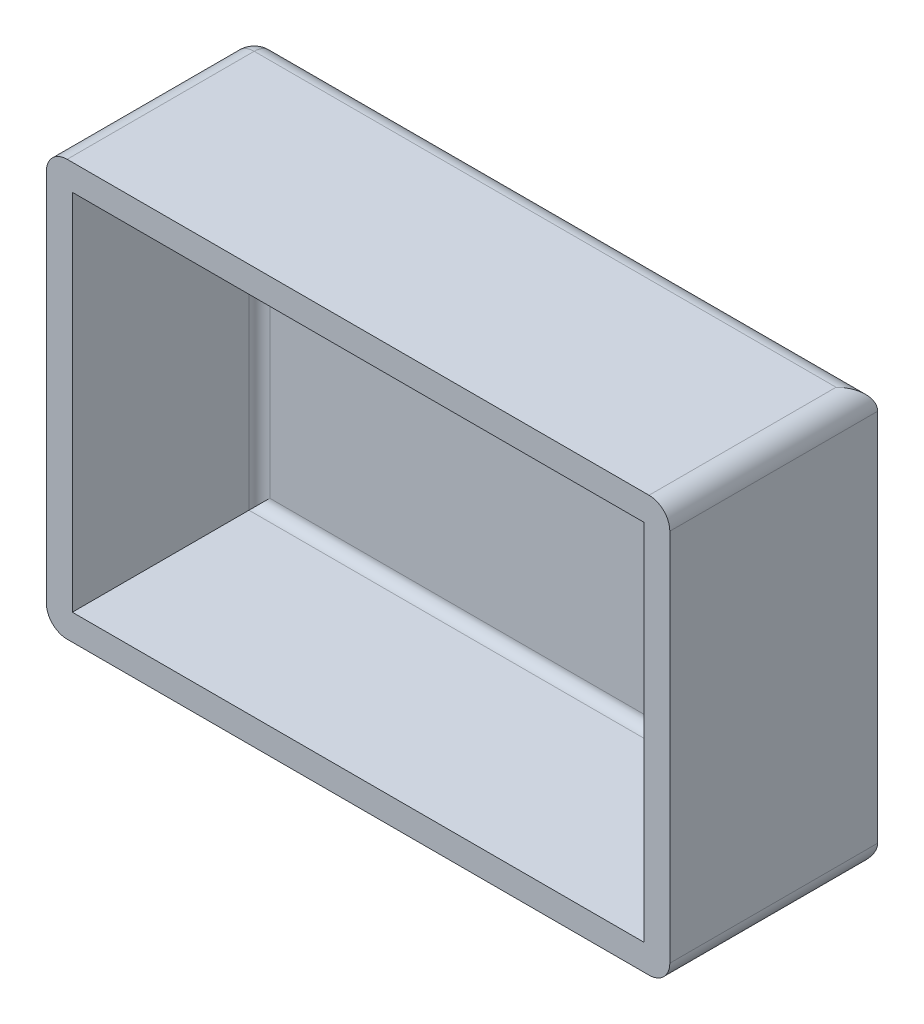
ISO-10303-21;
HEADER;
FILE_DESCRIPTION(('STEP AP214'),'2;1');
FILE_NAME('part.step','',(''),(''),'','','');
FILE_SCHEMA(('AUTOMOTIVE_DESIGN { 1 0 10303 214 1 1 1 1 }'));
ENDSEC;
DATA;
#1=APPLICATION_CONTEXT('core data for automotive mechanical design processes');
#2=APPLICATION_PROTOCOL_DEFINITION('international standard','automotive_design',2000,#1);
#3=PRODUCT_CONTEXT('',#1,'mechanical');
#4=PRODUCT('Part','Part','',(#3));
#5=PRODUCT_RELATED_PRODUCT_CATEGORY('part','',(#4));
#6=PRODUCT_DEFINITION_FORMATION('','',#4);
#7=PRODUCT_DEFINITION_CONTEXT('part definition',#1,'design');
#8=PRODUCT_DEFINITION('design','',#6,#7);
#9=PRODUCT_DEFINITION_SHAPE('','',#8);
#10=(LENGTH_UNIT() NAMED_UNIT(*) SI_UNIT(.MILLI.,.METRE.));
#11=(NAMED_UNIT(*) PLANE_ANGLE_UNIT() SI_UNIT($,.RADIAN.));
#12=(NAMED_UNIT(*) SI_UNIT($,.STERADIAN.) SOLID_ANGLE_UNIT());
#13=UNCERTAINTY_MEASURE_WITH_UNIT(LENGTH_MEASURE(1.E-05),#10,'distance_accuracy_value','');
#14=(GEOMETRIC_REPRESENTATION_CONTEXT(3) GLOBAL_UNCERTAINTY_ASSIGNED_CONTEXT((#13)) GLOBAL_UNIT_ASSIGNED_CONTEXT((#10,
#11,#12)) REPRESENTATION_CONTEXT('',''));
#15=CARTESIAN_POINT('',(0.,0.,0.));
#16=DIRECTION('',(0.,0.,1.));
#17=DIRECTION('',(1.,0.,0.));
#18=AXIS2_PLACEMENT_3D('',#15,#16,#17);
#19=CARTESIAN_POINT('',(30.,-20.,20.));
#20=DIRECTION('',(-1.,0.,0.));
#21=DIRECTION('',(0.,0.,1.));
#22=AXIS2_PLACEMENT_3D('',#19,#20,#21);
#23=PLANE('',#22);
#24=DIRECTION('',(0.,1.,0.));
#25=VECTOR('',#24,1.);
#26=CARTESIAN_POINT('',(30.,-20.,20.));
#27=LINE('',#26,#25);
#28=CARTESIAN_POINT('',(30.,-18.,20.));
#29=VERTEX_POINT('',#28);
#30=CARTESIAN_POINT('',(30.,18.,20.));
#31=VERTEX_POINT('',#30);
#32=EDGE_CURVE('E175',#29,#31,#27,.T.);
#33=ORIENTED_EDGE('',*,*,#32,.F.);
#34=DIRECTION('',(0.,0.,-1.));
#35=VECTOR('',#34,1.);
#36=CARTESIAN_POINT('',(30.,-18.,20.));
#37=LINE('',#36,#35);
#38=CARTESIAN_POINT('',(30.,-18.,0.));
#39=VERTEX_POINT('',#38);
#40=EDGE_CURVE('E244',#29,#39,#37,.T.);
#41=ORIENTED_EDGE('',*,*,#40,.T.);
#42=DIRECTION('',(0.,1.,0.));
#43=VECTOR('',#42,1.);
#44=CARTESIAN_POINT('',(30.,-20.,0.));
#45=LINE('',#44,#43);
#46=CARTESIAN_POINT('',(30.,18.,0.));
#47=VERTEX_POINT('',#46);
#48=EDGE_CURVE('E172',#39,#47,#45,.T.);
#49=ORIENTED_EDGE('',*,*,#48,.T.);
#50=DIRECTION('',(0.,0.,-1.));
#51=VECTOR('',#50,1.);
#52=CARTESIAN_POINT('',(30.,18.,20.));
#53=LINE('',#52,#51);
#54=EDGE_CURVE('E242',#47,#31,#53,.F.);
#55=ORIENTED_EDGE('',*,*,#54,.T.);
#56=EDGE_LOOP('',(#33,#41,#49,#55));
#57=FACE_BOUND('',#56,.T.);
#58=ADVANCED_FACE('F33',(#57),#23,.F.);
#59=CARTESIAN_POINT('',(-30.,20.,20.));
#60=DIRECTION('',(0.,-1.,0.));
#61=DIRECTION('',(0.,0.,-1.));
#62=AXIS2_PLACEMENT_3D('',#59,#60,#61);
#63=PLANE('',#62);
#64=DIRECTION('',(-1.,0.,0.));
#65=VECTOR('',#64,1.);
#66=CARTESIAN_POINT('',(-30.,20.,20.));
#67=LINE('',#66,#65);
#68=CARTESIAN_POINT('',(28.,20.,20.));
#69=VERTEX_POINT('',#68);
#70=CARTESIAN_POINT('',(-28.,20.,20.));
#71=VERTEX_POINT('',#70);
#72=EDGE_CURVE('E178',#69,#71,#67,.T.);
#73=ORIENTED_EDGE('',*,*,#72,.F.);
#74=DIRECTION('',(0.,0.,-1.));
#75=VECTOR('',#74,1.);
#76=CARTESIAN_POINT('',(28.,20.,20.));
#77=LINE('',#76,#75);
#78=CARTESIAN_POINT('',(28.,20.,2.));
#79=VERTEX_POINT('',#78);
#80=EDGE_CURVE('E11',#69,#79,#77,.T.);
#81=ORIENTED_EDGE('',*,*,#80,.T.);
#82=DIRECTION('',(-1.,0.,0.));
#83=VECTOR('',#82,1.);
#84=CARTESIAN_POINT('',(-30.,20.,2.));
#85=LINE('',#84,#83);
#86=CARTESIAN_POINT('',(-28.,20.,2.));
#87=VERTEX_POINT('',#86);
#88=EDGE_CURVE('E42',#79,#87,#85,.T.);
#89=ORIENTED_EDGE('',*,*,#88,.T.);
#90=DIRECTION('',(0.,0.,-1.));
#91=VECTOR('',#90,1.);
#92=CARTESIAN_POINT('',(-28.,20.,20.));
#93=LINE('',#92,#91);
#94=EDGE_CURVE('E246',#87,#71,#93,.F.);
#95=ORIENTED_EDGE('',*,*,#94,.T.);
#96=EDGE_LOOP('',(#73,#81,#89,#95));
#97=FACE_BOUND('',#96,.T.);
#98=ADVANCED_FACE('F325',(#97),#63,.F.);
#99=CARTESIAN_POINT('',(-30.,-20.,20.));
#100=DIRECTION('',(1.,0.,0.));
#101=DIRECTION('',(0.,0.,-1.));
#102=AXIS2_PLACEMENT_3D('',#99,#100,#101);
#103=PLANE('',#102);
#104=DIRECTION('',(0.,-1.,0.));
#105=VECTOR('',#104,1.);
#106=CARTESIAN_POINT('',(-30.,-20.,2.));
#107=LINE('',#106,#105);
#108=CARTESIAN_POINT('',(-30.,18.,2.));
#109=VERTEX_POINT('',#108);
#110=CARTESIAN_POINT('',(-30.,-18.,2.));
#111=VERTEX_POINT('',#110);
#112=EDGE_CURVE('E222',#109,#111,#107,.T.);
#113=ORIENTED_EDGE('',*,*,#112,.T.);
#114=DIRECTION('',(0.,0.,-1.));
#115=VECTOR('',#114,1.);
#116=CARTESIAN_POINT('',(-30.,-18.,20.));
#117=LINE('',#116,#115);
#118=CARTESIAN_POINT('',(-30.,-18.,20.));
#119=VERTEX_POINT('',#118);
#120=EDGE_CURVE('E226',#111,#119,#117,.F.);
#121=ORIENTED_EDGE('',*,*,#120,.T.);
#122=DIRECTION('',(0.,-1.,0.));
#123=VECTOR('',#122,1.);
#124=CARTESIAN_POINT('',(-30.,-20.,20.));
#125=LINE('',#124,#123);
#126=CARTESIAN_POINT('',(-30.,18.,20.));
#127=VERTEX_POINT('',#126);
#128=EDGE_CURVE('E181',#127,#119,#125,.T.);
#129=ORIENTED_EDGE('',*,*,#128,.F.);
#130=DIRECTION('',(0.,0.,-1.));
#131=VECTOR('',#130,1.);
#132=CARTESIAN_POINT('',(-30.,18.,20.));
#133=LINE('',#132,#131);
#134=EDGE_CURVE('E224',#127,#109,#133,.T.);
#135=ORIENTED_EDGE('',*,*,#134,.T.);
#136=EDGE_LOOP('',(#113,#121,#129,#135));
#137=FACE_BOUND('',#136,.T.);
#138=ADVANCED_FACE('F309',(#137),#103,.F.);
#139=CARTESIAN_POINT('',(-30.,-20.,20.));
#140=DIRECTION('',(0.,1.,0.));
#141=DIRECTION('',(0.,0.,1.));
#142=AXIS2_PLACEMENT_3D('',#139,#140,#141);
#143=PLANE('',#142);
#144=DIRECTION('',(1.,0.,0.));
#145=VECTOR('',#144,1.);
#146=CARTESIAN_POINT('',(-30.,-20.,20.));
#147=LINE('',#146,#145);
#148=CARTESIAN_POINT('',(-28.,-20.,20.));
#149=VERTEX_POINT('',#148);
#150=CARTESIAN_POINT('',(28.,-20.,20.));
#151=VERTEX_POINT('',#150);
#152=EDGE_CURVE('E184',#149,#151,#147,.T.);
#153=ORIENTED_EDGE('',*,*,#152,.F.);
#154=DIRECTION('',(0.,0.,-1.));
#155=VECTOR('',#154,1.);
#156=CARTESIAN_POINT('',(-28.,-20.,20.));
#157=LINE('',#156,#155);
#158=CARTESIAN_POINT('',(-28.,-20.,2.));
#159=VERTEX_POINT('',#158);
#160=EDGE_CURVE('E219',#149,#159,#157,.T.);
#161=ORIENTED_EDGE('',*,*,#160,.T.);
#162=DIRECTION('',(1.,0.,0.));
#163=VECTOR('',#162,1.);
#164=CARTESIAN_POINT('',(30.,-20.,2.));
#165=LINE('',#164,#163);
#166=CARTESIAN_POINT('',(28.,-20.,2.));
#167=VERTEX_POINT('',#166);
#168=EDGE_CURVE('E217',#159,#167,#165,.T.);
#169=ORIENTED_EDGE('',*,*,#168,.T.);
#170=DIRECTION('',(0.,0.,-1.));
#171=VECTOR('',#170,1.);
#172=CARTESIAN_POINT('',(28.,-20.,20.));
#173=LINE('',#172,#171);
#174=EDGE_CURVE('E205',#167,#151,#173,.F.);
#175=ORIENTED_EDGE('',*,*,#174,.T.);
#176=EDGE_LOOP('',(#153,#161,#169,#175));
#177=FACE_BOUND('',#176,.T.);
#178=ADVANCED_FACE('F480',(#177),#143,.F.);
#179=CARTESIAN_POINT('',(0.,0.,20.));
#180=DIRECTION('',(0.,0.,-1.));
#181=DIRECTION('',(-1.,0.,0.));
#182=AXIS2_PLACEMENT_3D('',#179,#180,#181);
#183=PLANE('',#182);
#184=DIRECTION('',(-1.,0.,0.));
#185=VECTOR('',#184,1.);
#186=CARTESIAN_POINT('',(-27.5,17.5,20.));
#187=LINE('',#186,#185);
#188=CARTESIAN_POINT('',(27.5,17.5,20.));
#189=VERTEX_POINT('',#188);
#190=CARTESIAN_POINT('',(-27.5,17.5,20.));
#191=VERTEX_POINT('',#190);
#192=EDGE_CURVE('E154',#189,#191,#187,.T.);
#193=ORIENTED_EDGE('',*,*,#192,.F.);
#194=DIRECTION('',(0.,1.,0.));
#195=VECTOR('',#194,1.);
#196=CARTESIAN_POINT('',(27.5,-17.5,20.));
#197=LINE('',#196,#195);
#198=CARTESIAN_POINT('',(27.5,-17.5,20.));
#199=VERTEX_POINT('',#198);
#200=EDGE_CURVE('E160',#199,#189,#197,.T.);
#201=ORIENTED_EDGE('',*,*,#200,.F.);
#202=DIRECTION('',(1.,0.,0.));
#203=VECTOR('',#202,1.);
#204=CARTESIAN_POINT('',(-27.5,-17.5,20.));
#205=LINE('',#204,#203);
#206=CARTESIAN_POINT('',(-27.5,-17.5,20.));
#207=VERTEX_POINT('',#206);
#208=EDGE_CURVE('E165',#207,#199,#205,.T.);
#209=ORIENTED_EDGE('',*,*,#208,.F.);
#210=DIRECTION('',(0.,-1.,0.));
#211=VECTOR('',#210,1.);
#212=CARTESIAN_POINT('',(-27.5,-17.5,20.));
#213=LINE('',#212,#211);
#214=EDGE_CURVE('E145',#191,#207,#213,.T.);
#215=ORIENTED_EDGE('',*,*,#214,.F.);
#216=EDGE_LOOP('',(#193,#201,#209,#215));
#217=FACE_BOUND('',#216,.T.);
#218=ORIENTED_EDGE('',*,*,#128,.T.);
#219=CARTESIAN_POINT('',(-28.,-18.,20.));
#220=DIRECTION('',(0.,0.,-1.));
#221=DIRECTION('',(-1.,0.,0.));
#222=AXIS2_PLACEMENT_3D('',#219,#220,#221);
#223=CIRCLE('',#222,2.);
#224=EDGE_CURVE('E234',#119,#149,#223,.F.);
#225=ORIENTED_EDGE('',*,*,#224,.T.);
#226=ORIENTED_EDGE('',*,*,#152,.T.);
#227=CARTESIAN_POINT('',(28.,-18.,20.));
#228=DIRECTION('',(0.,0.,-1.));
#229=DIRECTION('',(-1.,0.,0.));
#230=AXIS2_PLACEMENT_3D('',#227,#228,#229);
#231=CIRCLE('',#230,2.);
#232=EDGE_CURVE('E232',#151,#29,#231,.F.);
#233=ORIENTED_EDGE('',*,*,#232,.T.);
#234=ORIENTED_EDGE('',*,*,#32,.T.);
#235=CARTESIAN_POINT('',(28.,18.,20.));
#236=DIRECTION('',(0.,0.,-1.));
#237=DIRECTION('',(-1.,0.,0.));
#238=AXIS2_PLACEMENT_3D('',#235,#236,#237);
#239=CIRCLE('',#238,2.);
#240=EDGE_CURVE('E230',#31,#69,#239,.F.);
#241=ORIENTED_EDGE('',*,*,#240,.T.);
#242=ORIENTED_EDGE('',*,*,#72,.T.);
#243=CARTESIAN_POINT('',(-28.,18.,20.));
#244=DIRECTION('',(0.,0.,-1.));
#245=DIRECTION('',(-1.,0.,0.));
#246=AXIS2_PLACEMENT_3D('',#243,#244,#245);
#247=CIRCLE('',#246,2.);
#248=EDGE_CURVE('E228',#71,#127,#247,.F.);
#249=ORIENTED_EDGE('',*,*,#248,.T.);
#250=EDGE_LOOP('',(#218,#225,#226,#233,#234,#241,#242,#249));
#251=FACE_BOUND('',#250,.T.);
#252=ADVANCED_FACE('F162',(#217,#251),#183,.F.);
#253=CARTESIAN_POINT('',(0.,0.,0.));
#254=DIRECTION('',(0.,0.,-1.));
#255=DIRECTION('',(-1.,0.,0.));
#256=AXIS2_PLACEMENT_3D('',#253,#254,#255);
#257=PLANE('',#256);
#258=ORIENTED_EDGE('',*,*,#48,.F.);
#259=DIRECTION('',(1.,0.,0.));
#260=VECTOR('',#259,1.);
#261=CARTESIAN_POINT('',(-30.,-18.,0.));
#262=LINE('',#261,#260);
#263=CARTESIAN_POINT('',(-28.,-18.,0.));
#264=VERTEX_POINT('',#263);
#265=EDGE_CURVE('E240',#39,#264,#262,.F.);
#266=ORIENTED_EDGE('',*,*,#265,.T.);
#267=DIRECTION('',(0.,-1.,0.));
#268=VECTOR('',#267,1.);
#269=CARTESIAN_POINT('',(-28.,20.,0.));
#270=LINE('',#269,#268);
#271=CARTESIAN_POINT('',(-28.,18.,0.));
#272=VERTEX_POINT('',#271);
#273=EDGE_CURVE('E236',#264,#272,#270,.F.);
#274=ORIENTED_EDGE('',*,*,#273,.T.);
#275=DIRECTION('',(-1.,0.,0.));
#276=VECTOR('',#275,1.);
#277=CARTESIAN_POINT('',(30.,18.,0.));
#278=LINE('',#277,#276);
#279=EDGE_CURVE('E238',#272,#47,#278,.F.);
#280=ORIENTED_EDGE('',*,*,#279,.T.);
#281=EDGE_LOOP('',(#258,#266,#274,#280));
#282=FACE_BOUND('',#281,.T.);
#283=ADVANCED_FACE('F289',(#282),#257,.T.);
#284=CARTESIAN_POINT('',(27.5,-17.5,2.));
#285=DIRECTION('',(1.,0.,0.));
#286=DIRECTION('',(0.,0.,-1.));
#287=AXIS2_PLACEMENT_3D('',#284,#285,#286);
#288=PLANE('',#287);
#289=DIRECTION('',(0.,0.,1.));
#290=VECTOR('',#289,1.);
#291=CARTESIAN_POINT('',(27.5,17.5,2.));
#292=LINE('',#291,#290);
#293=CARTESIAN_POINT('',(27.5,17.5,3.));
#294=VERTEX_POINT('',#293);
#295=EDGE_CURVE('E151',#294,#189,#292,.T.);
#296=ORIENTED_EDGE('',*,*,#295,.F.);
#297=DIRECTION('',(0.,1.,0.));
#298=VECTOR('',#297,1.);
#299=CARTESIAN_POINT('',(27.5,-17.5,3.));
#300=LINE('',#299,#298);
#301=CARTESIAN_POINT('',(27.5,-17.5,3.));
#302=VERTEX_POINT('',#301);
#303=EDGE_CURVE('E199',#294,#302,#300,.F.);
#304=ORIENTED_EDGE('',*,*,#303,.T.);
#305=DIRECTION('',(0.,0.,1.));
#306=VECTOR('',#305,1.);
#307=CARTESIAN_POINT('',(27.5,-17.5,2.));
#308=LINE('',#307,#306);
#309=EDGE_CURVE('E170',#302,#199,#308,.T.);
#310=ORIENTED_EDGE('',*,*,#309,.T.);
#311=ORIENTED_EDGE('',*,*,#200,.T.);
#312=EDGE_LOOP('',(#296,#304,#310,#311));
#313=FACE_BOUND('',#312,.T.);
#314=ADVANCED_FACE('F457',(#313),#288,.F.);
#315=CARTESIAN_POINT('',(-27.5,-17.5,2.));
#316=DIRECTION('',(0.,-1.,0.));
#317=DIRECTION('',(0.,0.,-1.));
#318=AXIS2_PLACEMENT_3D('',#315,#316,#317);
#319=PLANE('',#318);
#320=ORIENTED_EDGE('',*,*,#309,.F.);
#321=DIRECTION('',(1.,0.,0.));
#322=VECTOR('',#321,1.);
#323=CARTESIAN_POINT('',(-27.5,-17.5,3.));
#324=LINE('',#323,#322);
#325=CARTESIAN_POINT('',(-27.5,-17.5,3.));
#326=VERTEX_POINT('',#325);
#327=EDGE_CURVE('E201',#302,#326,#324,.F.);
#328=ORIENTED_EDGE('',*,*,#327,.T.);
#329=DIRECTION('',(0.,0.,1.));
#330=VECTOR('',#329,1.);
#331=CARTESIAN_POINT('',(-27.5,-17.5,2.));
#332=LINE('',#331,#330);
#333=EDGE_CURVE('E150',#326,#207,#332,.T.);
#334=ORIENTED_EDGE('',*,*,#333,.T.);
#335=ORIENTED_EDGE('',*,*,#208,.T.);
#336=EDGE_LOOP('',(#320,#328,#334,#335));
#337=FACE_BOUND('',#336,.T.);
#338=ADVANCED_FACE('F449',(#337),#319,.F.);
#339=CARTESIAN_POINT('',(-27.5,-17.5,2.));
#340=DIRECTION('',(-1.,0.,0.));
#341=DIRECTION('',(0.,0.,1.));
#342=AXIS2_PLACEMENT_3D('',#339,#340,#341);
#343=PLANE('',#342);
#344=ORIENTED_EDGE('',*,*,#333,.F.);
#345=DIRECTION('',(0.,-1.,0.));
#346=VECTOR('',#345,1.);
#347=CARTESIAN_POINT('',(-27.5,17.5,3.));
#348=LINE('',#347,#346);
#349=CARTESIAN_POINT('',(-27.5,17.5,3.));
#350=VERTEX_POINT('',#349);
#351=EDGE_CURVE('E148',#326,#350,#348,.F.);
#352=ORIENTED_EDGE('',*,*,#351,.T.);
#353=DIRECTION('',(0.,0.,1.));
#354=VECTOR('',#353,1.);
#355=CARTESIAN_POINT('',(-27.5,17.5,2.));
#356=LINE('',#355,#354);
#357=EDGE_CURVE('E140',#350,#191,#356,.T.);
#358=ORIENTED_EDGE('',*,*,#357,.T.);
#359=ORIENTED_EDGE('',*,*,#214,.T.);
#360=EDGE_LOOP('',(#344,#352,#358,#359));
#361=FACE_BOUND('',#360,.T.);
#362=ADVANCED_FACE('F143',(#361),#343,.F.);
#363=CARTESIAN_POINT('',(-27.5,17.5,2.));
#364=DIRECTION('',(0.,1.,0.));
#365=DIRECTION('',(0.,0.,1.));
#366=AXIS2_PLACEMENT_3D('',#363,#364,#365);
#367=PLANE('',#366);
#368=ORIENTED_EDGE('',*,*,#357,.F.);
#369=DIRECTION('',(-1.,0.,0.));
#370=VECTOR('',#369,1.);
#371=CARTESIAN_POINT('',(27.5,17.5,3.));
#372=LINE('',#371,#370);
#373=EDGE_CURVE('E203',#350,#294,#372,.F.);
#374=ORIENTED_EDGE('',*,*,#373,.T.);
#375=ORIENTED_EDGE('',*,*,#295,.T.);
#376=ORIENTED_EDGE('',*,*,#192,.T.);
#377=EDGE_LOOP('',(#368,#374,#375,#376));
#378=FACE_BOUND('',#377,.T.);
#379=ADVANCED_FACE('F155',(#378),#367,.F.);
#380=CARTESIAN_POINT('',(0.,0.,2.));
#381=DIRECTION('',(0.,0.,-1.));
#382=DIRECTION('',(-1.,0.,0.));
#383=AXIS2_PLACEMENT_3D('',#380,#381,#382);
#384=PLANE('',#383);
#385=DIRECTION('',(0.,-1.,0.));
#386=VECTOR('',#385,1.);
#387=CARTESIAN_POINT('',(-26.5,-17.5,2.));
#388=LINE('',#387,#386);
#389=CARTESIAN_POINT('',(-26.5,16.5,2.));
#390=VERTEX_POINT('',#389);
#391=CARTESIAN_POINT('',(-26.5,-16.5,2.));
#392=VERTEX_POINT('',#391);
#393=EDGE_CURVE('E193',#390,#392,#388,.T.);
#394=ORIENTED_EDGE('',*,*,#393,.T.);
#395=DIRECTION('',(1.,0.,0.));
#396=VECTOR('',#395,1.);
#397=CARTESIAN_POINT('',(27.5,-16.5,2.));
#398=LINE('',#397,#396);
#399=CARTESIAN_POINT('',(26.5,-16.5,2.));
#400=VERTEX_POINT('',#399);
#401=EDGE_CURVE('E196',#392,#400,#398,.T.);
#402=ORIENTED_EDGE('',*,*,#401,.T.);
#403=DIRECTION('',(0.,1.,0.));
#404=VECTOR('',#403,1.);
#405=CARTESIAN_POINT('',(26.5,17.5,2.));
#406=LINE('',#405,#404);
#407=CARTESIAN_POINT('',(26.5,16.5,2.));
#408=VERTEX_POINT('',#407);
#409=EDGE_CURVE('E191',#400,#408,#406,.T.);
#410=ORIENTED_EDGE('',*,*,#409,.T.);
#411=DIRECTION('',(-1.,0.,0.));
#412=VECTOR('',#411,1.);
#413=CARTESIAN_POINT('',(-27.5,16.5,2.));
#414=LINE('',#413,#412);
#415=EDGE_CURVE('E187',#408,#390,#414,.T.);
#416=ORIENTED_EDGE('',*,*,#415,.T.);
#417=EDGE_LOOP('',(#394,#402,#410,#416));
#418=FACE_BOUND('',#417,.T.);
#419=ADVANCED_FACE('F349',(#418),#384,.F.);
#420=CARTESIAN_POINT('',(26.5,0.,3.));
#421=DIRECTION('',(0.,-1.,0.));
#422=DIRECTION('',(0.,0.,-1.));
#423=AXIS2_PLACEMENT_3D('',#420,#421,#422);
#424=CYLINDRICAL_SURFACE('',#423,1.);
#425=CARTESIAN_POINT('',(26.5,-16.5,3.));
#426=DIRECTION('',(-0.707106781186547,-0.707106781186547,0.));
#427=DIRECTION('',(0.707106781186547,-0.707106781186547,0.));
#428=AXIS2_PLACEMENT_3D('',#425,#426,#427);
#429=ELLIPSE('',#428,1.41421356237309,1.);
#430=EDGE_CURVE('E210',#302,#400,#429,.F.);
#431=ORIENTED_EDGE('',*,*,#430,.F.);
#432=ORIENTED_EDGE('',*,*,#303,.F.);
#433=CARTESIAN_POINT('',(26.5,16.5,3.));
#434=DIRECTION('',(0.707106781186547,-0.707106781186547,0.));
#435=DIRECTION('',(-0.707106781186547,-0.707106781186547,0.));
#436=AXIS2_PLACEMENT_3D('',#433,#434,#435);
#437=ELLIPSE('',#436,1.41421356237309,1.);
#438=EDGE_CURVE('E213',#408,#294,#437,.T.);
#439=ORIENTED_EDGE('',*,*,#438,.F.);
#440=ORIENTED_EDGE('',*,*,#409,.F.);
#441=EDGE_LOOP('',(#431,#432,#439,#440));
#442=FACE_BOUND('',#441,.T.);
#443=ADVANCED_FACE('F345',(#442),#424,.F.);
#444=CARTESIAN_POINT('',(0.,16.5,3.));
#445=DIRECTION('',(1.,0.,0.));
#446=DIRECTION('',(0.,0.,-1.));
#447=AXIS2_PLACEMENT_3D('',#444,#445,#446);
#448=CYLINDRICAL_SURFACE('',#447,1.);
#449=ORIENTED_EDGE('',*,*,#438,.T.);
#450=ORIENTED_EDGE('',*,*,#373,.F.);
#451=CARTESIAN_POINT('',(-26.5,16.5,3.));
#452=DIRECTION('',(0.707106781186547,0.707106781186547,0.));
#453=DIRECTION('',(-0.707106781186547,0.707106781186547,0.));
#454=AXIS2_PLACEMENT_3D('',#451,#452,#453);
#455=ELLIPSE('',#454,1.41421356237309,1.);
#456=EDGE_CURVE('E208',#390,#350,#455,.T.);
#457=ORIENTED_EDGE('',*,*,#456,.F.);
#458=ORIENTED_EDGE('',*,*,#415,.F.);
#459=EDGE_LOOP('',(#449,#450,#457,#458));
#460=FACE_BOUND('',#459,.T.);
#461=ADVANCED_FACE('F341',(#460),#448,.F.);
#462=CARTESIAN_POINT('',(0.,-16.5,3.));
#463=DIRECTION('',(-1.,0.,0.));
#464=DIRECTION('',(0.,0.,1.));
#465=AXIS2_PLACEMENT_3D('',#462,#463,#464);
#466=CYLINDRICAL_SURFACE('',#465,1.);
#467=ORIENTED_EDGE('',*,*,#430,.T.);
#468=ORIENTED_EDGE('',*,*,#401,.F.);
#469=CARTESIAN_POINT('',(-26.5,-16.5,3.));
#470=DIRECTION('',(-0.707106781186547,0.707106781186547,0.));
#471=DIRECTION('',(0.707106781186547,0.707106781186547,0.));
#472=AXIS2_PLACEMENT_3D('',#469,#470,#471);
#473=ELLIPSE('',#472,1.41421356237309,1.);
#474=EDGE_CURVE('E206',#326,#392,#473,.F.);
#475=ORIENTED_EDGE('',*,*,#474,.F.);
#476=ORIENTED_EDGE('',*,*,#327,.F.);
#477=EDGE_LOOP('',(#467,#468,#475,#476));
#478=FACE_BOUND('',#477,.T.);
#479=ADVANCED_FACE('F337',(#478),#466,.F.);
#480=CARTESIAN_POINT('',(-26.5,0.,3.));
#481=DIRECTION('',(0.,1.,0.));
#482=DIRECTION('',(0.,0.,1.));
#483=AXIS2_PLACEMENT_3D('',#480,#481,#482);
#484=CYLINDRICAL_SURFACE('',#483,1.);
#485=ORIENTED_EDGE('',*,*,#456,.T.);
#486=ORIENTED_EDGE('',*,*,#351,.F.);
#487=ORIENTED_EDGE('',*,*,#474,.T.);
#488=ORIENTED_EDGE('',*,*,#393,.F.);
#489=EDGE_LOOP('',(#485,#486,#487,#488));
#490=FACE_BOUND('',#489,.T.);
#491=ADVANCED_FACE('F334',(#490),#484,.F.);
#492=CARTESIAN_POINT('',(28.,18.,20.));
#493=DIRECTION('',(0.,0.,-1.));
#494=DIRECTION('',(-1.,0.,0.));
#495=AXIS2_PLACEMENT_3D('',#492,#493,#494);
#496=CYLINDRICAL_SURFACE('',#495,2.);
#497=ORIENTED_EDGE('',*,*,#240,.F.);
#498=ORIENTED_EDGE('',*,*,#54,.F.);
#499=CARTESIAN_POINT('',(28.,18.,2.));
#500=DIRECTION('',(0.707106781186547,0.,0.707106781186547));
#501=DIRECTION('',(0.707106781186547,0.,-0.707106781186547));
#502=AXIS2_PLACEMENT_3D('',#499,#500,#501);
#503=ELLIPSE('',#502,2.82842712474619,2.);
#504=EDGE_CURVE('E37',#79,#47,#503,.F.);
#505=ORIENTED_EDGE('',*,*,#504,.F.);
#506=ORIENTED_EDGE('',*,*,#80,.F.);
#507=EDGE_LOOP('',(#497,#498,#505,#506));
#508=FACE_BOUND('',#507,.T.);
#509=ADVANCED_FACE('F35',(#508),#496,.T.);
#510=CARTESIAN_POINT('',(-30.,18.,2.));
#511=DIRECTION('',(1.,0.,0.));
#512=DIRECTION('',(0.,0.,-1.));
#513=AXIS2_PLACEMENT_3D('',#510,#511,#512);
#514=CYLINDRICAL_SURFACE('',#513,2.);
#515=ORIENTED_EDGE('',*,*,#504,.T.);
#516=ORIENTED_EDGE('',*,*,#279,.F.);
#517=CARTESIAN_POINT('',(-28.,18.,2.));
#518=DIRECTION('',(-1.,0.,0.));
#519=DIRECTION('',(0.,0.,1.));
#520=AXIS2_PLACEMENT_3D('',#517,#518,#519);
#521=CIRCLE('',#520,2.);
#522=EDGE_CURVE('E265',#87,#272,#521,.T.);
#523=ORIENTED_EDGE('',*,*,#522,.F.);
#524=ORIENTED_EDGE('',*,*,#88,.F.);
#525=EDGE_LOOP('',(#515,#516,#523,#524));
#526=FACE_BOUND('',#525,.T.);
#527=ADVANCED_FACE('F273',(#526),#514,.T.);
#528=CARTESIAN_POINT('',(-28.,18.,20.));
#529=DIRECTION('',(0.,0.,-1.));
#530=DIRECTION('',(-1.,0.,0.));
#531=AXIS2_PLACEMENT_3D('',#528,#529,#530);
#532=CYLINDRICAL_SURFACE('',#531,2.);
#533=ORIENTED_EDGE('',*,*,#248,.F.);
#534=ORIENTED_EDGE('',*,*,#94,.F.);
#535=CARTESIAN_POINT('',(-28.,18.,2.));
#536=DIRECTION('',(0.,0.,-1.));
#537=DIRECTION('',(-1.,0.,0.));
#538=AXIS2_PLACEMENT_3D('',#535,#536,#537);
#539=CIRCLE('',#538,2.);
#540=EDGE_CURVE('E263',#109,#87,#539,.T.);
#541=ORIENTED_EDGE('',*,*,#540,.F.);
#542=ORIENTED_EDGE('',*,*,#134,.F.);
#543=EDGE_LOOP('',(#533,#534,#541,#542));
#544=FACE_BOUND('',#543,.T.);
#545=ADVANCED_FACE('F313',(#544),#532,.T.);
#546=CARTESIAN_POINT('',(28.,-18.,20.));
#547=DIRECTION('',(0.,0.,-1.));
#548=DIRECTION('',(-1.,0.,0.));
#549=AXIS2_PLACEMENT_3D('',#546,#547,#548);
#550=CYLINDRICAL_SURFACE('',#549,2.);
#551=ORIENTED_EDGE('',*,*,#232,.F.);
#552=ORIENTED_EDGE('',*,*,#174,.F.);
#553=CARTESIAN_POINT('',(28.,-18.,2.));
#554=DIRECTION('',(-0.707106781186547,0.,-0.707106781186547));
#555=DIRECTION('',(0.707106781186547,0.,-0.707106781186547));
#556=AXIS2_PLACEMENT_3D('',#553,#554,#555);
#557=ELLIPSE('',#556,2.82842712474619,2.);
#558=EDGE_CURVE('E260',#39,#167,#557,.T.);
#559=ORIENTED_EDGE('',*,*,#558,.F.);
#560=ORIENTED_EDGE('',*,*,#40,.F.);
#561=EDGE_LOOP('',(#551,#552,#559,#560));
#562=FACE_BOUND('',#561,.T.);
#563=ADVANCED_FACE('F285',(#562),#550,.T.);
#564=CARTESIAN_POINT('',(-28.,18.,2.));
#565=DIRECTION('',(0.,1.,0.));
#566=DIRECTION('',(0.,0.,1.));
#567=AXIS2_PLACEMENT_3D('',#564,#565,#566);
#568=SPHERICAL_SURFACE('',#567,2.);
#569=ORIENTED_EDGE('',*,*,#540,.T.);
#570=ORIENTED_EDGE('',*,*,#522,.T.);
#571=CARTESIAN_POINT('',(-28.,18.,2.));
#572=DIRECTION('',(0.,1.,0.));
#573=DIRECTION('',(-1.,0.,0.));
#574=AXIS2_PLACEMENT_3D('',#571,#572,#573);
#575=CIRCLE('',#574,2.);
#576=EDGE_CURVE('E257',#109,#272,#575,.F.);
#577=ORIENTED_EDGE('',*,*,#576,.F.);
#578=EDGE_LOOP('',(#569,#570,#577));
#579=FACE_BOUND('',#578,.T.);
#580=ADVANCED_FACE('F315',(#579),#568,.T.);
#581=CARTESIAN_POINT('',(-30.,-18.,2.));
#582=DIRECTION('',(-1.,0.,0.));
#583=DIRECTION('',(0.,0.,1.));
#584=AXIS2_PLACEMENT_3D('',#581,#582,#583);
#585=CYLINDRICAL_SURFACE('',#584,2.);
#586=ORIENTED_EDGE('',*,*,#558,.T.);
#587=ORIENTED_EDGE('',*,*,#168,.F.);
#588=CARTESIAN_POINT('',(-28.,-18.,2.));
#589=DIRECTION('',(-1.,0.,0.));
#590=DIRECTION('',(0.,0.,1.));
#591=AXIS2_PLACEMENT_3D('',#588,#589,#590);
#592=CIRCLE('',#591,2.);
#593=EDGE_CURVE('E254',#264,#159,#592,.T.);
#594=ORIENTED_EDGE('',*,*,#593,.F.);
#595=ORIENTED_EDGE('',*,*,#265,.F.);
#596=EDGE_LOOP('',(#586,#587,#594,#595));
#597=FACE_BOUND('',#596,.T.);
#598=ADVANCED_FACE('F299',(#597),#585,.T.);
#599=CARTESIAN_POINT('',(-28.,-20.,2.));
#600=DIRECTION('',(0.,1.,0.));
#601=DIRECTION('',(0.,0.,1.));
#602=AXIS2_PLACEMENT_3D('',#599,#600,#601);
#603=CYLINDRICAL_SURFACE('',#602,2.);
#604=ORIENTED_EDGE('',*,*,#576,.T.);
#605=ORIENTED_EDGE('',*,*,#273,.F.);
#606=CARTESIAN_POINT('',(-28.,-18.,2.));
#607=DIRECTION('',(0.,-1.,0.));
#608=DIRECTION('',(0.,0.,-1.));
#609=AXIS2_PLACEMENT_3D('',#606,#607,#608);
#610=CIRCLE('',#609,2.);
#611=EDGE_CURVE('E251',#111,#264,#610,.T.);
#612=ORIENTED_EDGE('',*,*,#611,.F.);
#613=ORIENTED_EDGE('',*,*,#112,.F.);
#614=EDGE_LOOP('',(#604,#605,#612,#613));
#615=FACE_BOUND('',#614,.T.);
#616=ADVANCED_FACE('F294',(#615),#603,.T.);
#617=CARTESIAN_POINT('',(-28.,-18.,2.));
#618=DIRECTION('',(0.,0.,-1.));
#619=DIRECTION('',(-1.,0.,0.));
#620=AXIS2_PLACEMENT_3D('',#617,#618,#619);
#621=SPHERICAL_SURFACE('',#620,2.);
#622=ORIENTED_EDGE('',*,*,#611,.T.);
#623=ORIENTED_EDGE('',*,*,#593,.T.);
#624=CARTESIAN_POINT('',(-28.,-18.,2.));
#625=DIRECTION('',(0.,0.,-1.));
#626=DIRECTION('',(-1.,0.,0.));
#627=AXIS2_PLACEMENT_3D('',#624,#625,#626);
#628=CIRCLE('',#627,2.);
#629=EDGE_CURVE('E249',#111,#159,#628,.F.);
#630=ORIENTED_EDGE('',*,*,#629,.F.);
#631=EDGE_LOOP('',(#622,#623,#630));
#632=FACE_BOUND('',#631,.T.);
#633=ADVANCED_FACE('F302',(#632),#621,.T.);
#634=CARTESIAN_POINT('',(-28.,-18.,20.));
#635=DIRECTION('',(0.,0.,-1.));
#636=DIRECTION('',(-1.,0.,0.));
#637=AXIS2_PLACEMENT_3D('',#634,#635,#636);
#638=CYLINDRICAL_SURFACE('',#637,2.);
#639=ORIENTED_EDGE('',*,*,#224,.F.);
#640=ORIENTED_EDGE('',*,*,#120,.F.);
#641=ORIENTED_EDGE('',*,*,#629,.T.);
#642=ORIENTED_EDGE('',*,*,#160,.F.);
#643=EDGE_LOOP('',(#639,#640,#641,#642));
#644=FACE_BOUND('',#643,.T.);
#645=ADVANCED_FACE('F306',(#644),#638,.T.);
#646=CLOSED_SHELL('',(#58,#98,#138,#178,#252,#283,#314,#338,#362,#379,#419,#443,#461,#479,#491,
#509,#527,#545,#563,#580,#598,#616,#633,#645));
#647=MANIFOLD_SOLID_BREP('B2',#646);
#648=ADVANCED_BREP_SHAPE_REPRESENTATION('',(#18,#647),#14);
#649=SHAPE_DEFINITION_REPRESENTATION(#9,#648);
ENDSEC;
END-ISO-10303-21;
